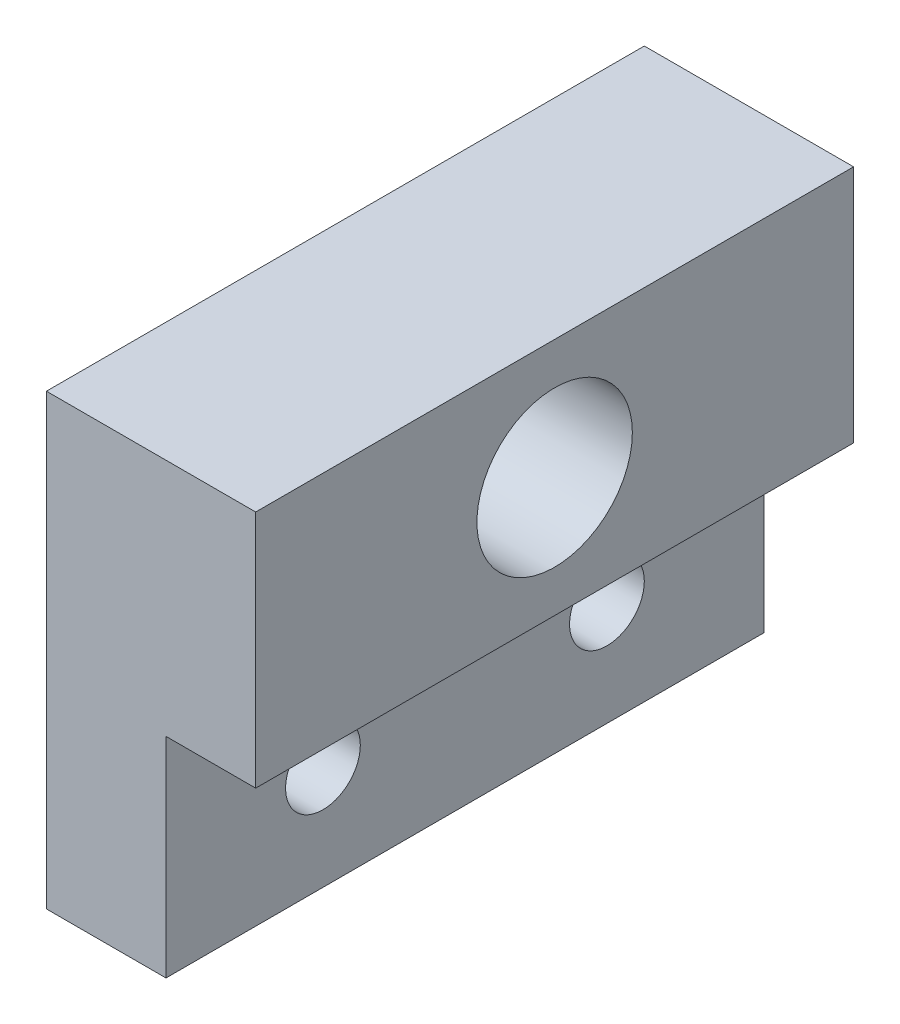
ISO-10303-21;
HEADER;
FILE_DESCRIPTION(('STEP AP214'),'2;1');
FILE_NAME('part.step','',(''),(''),'','','');
FILE_SCHEMA(('AUTOMOTIVE_DESIGN { 1 0 10303 214 1 1 1 1 }'));
ENDSEC;
DATA;
#1=APPLICATION_CONTEXT('core data for automotive mechanical design processes');
#2=APPLICATION_PROTOCOL_DEFINITION('international standard','automotive_design',2000,#1);
#3=PRODUCT_CONTEXT('',#1,'mechanical');
#4=PRODUCT('Part','Part','',(#3));
#5=PRODUCT_RELATED_PRODUCT_CATEGORY('part','',(#4));
#6=PRODUCT_DEFINITION_FORMATION('','',#4);
#7=PRODUCT_DEFINITION_CONTEXT('part definition',#1,'design');
#8=PRODUCT_DEFINITION('design','',#6,#7);
#9=PRODUCT_DEFINITION_SHAPE('','',#8);
#10=(LENGTH_UNIT() NAMED_UNIT(*) SI_UNIT(.MILLI.,.METRE.));
#11=(NAMED_UNIT(*) PLANE_ANGLE_UNIT() SI_UNIT($,.RADIAN.));
#12=(NAMED_UNIT(*) SI_UNIT($,.STERADIAN.) SOLID_ANGLE_UNIT());
#13=UNCERTAINTY_MEASURE_WITH_UNIT(LENGTH_MEASURE(1.E-05),#10,'distance_accuracy_value','');
#14=(GEOMETRIC_REPRESENTATION_CONTEXT(3) GLOBAL_UNCERTAINTY_ASSIGNED_CONTEXT((#13)) GLOBAL_UNIT_ASSIGNED_CONTEXT((#10,
#11,#12)) REPRESENTATION_CONTEXT('',''));
#15=CARTESIAN_POINT('',(0.,0.,0.));
#16=DIRECTION('',(0.,0.,1.));
#17=DIRECTION('',(1.,0.,0.));
#18=AXIS2_PLACEMENT_3D('',#15,#16,#17);
#19=CARTESIAN_POINT('',(7.,7.,20.));
#20=DIRECTION('',(-1.,0.,0.));
#21=DIRECTION('',(0.,0.,1.));
#22=AXIS2_PLACEMENT_3D('',#19,#20,#21);
#23=PLANE('',#22);
#24=CARTESIAN_POINT('',(7.,11.,10.));
#25=DIRECTION('',(1.,0.,0.));
#26=DIRECTION('',(0.,0.,-1.));
#27=AXIS2_PLACEMENT_3D('',#24,#25,#26);
#28=CIRCLE('',#27,2.6);
#29=CARTESIAN_POINT('',(7.,11.,7.4));
#30=VERTEX_POINT('',#29);
#31=EDGE_CURVE('E160',#30,#30,#28,.T.);
#32=ORIENTED_EDGE('',*,*,#31,.F.);
#33=EDGE_LOOP('',(#32));
#34=FACE_BOUND('',#33,.T.);
#35=DIRECTION('',(0.,1.,0.));
#36=VECTOR('',#35,1.);
#37=CARTESIAN_POINT('',(7.,7.,0.));
#38=LINE('',#37,#36);
#39=CARTESIAN_POINT('',(7.,7.,0.));
#40=VERTEX_POINT('',#39);
#41=CARTESIAN_POINT('',(7.,15.,0.));
#42=VERTEX_POINT('',#41);
#43=EDGE_CURVE('E117',#40,#42,#38,.T.);
#44=ORIENTED_EDGE('',*,*,#43,.T.);
#45=DIRECTION('',(0.,0.,-1.));
#46=VECTOR('',#45,1.);
#47=CARTESIAN_POINT('',(7.,15.,20.));
#48=LINE('',#47,#46);
#49=CARTESIAN_POINT('',(7.,15.,20.));
#50=VERTEX_POINT('',#49);
#51=EDGE_CURVE('E11',#50,#42,#48,.T.);
#52=ORIENTED_EDGE('',*,*,#51,.F.);
#53=DIRECTION('',(0.,1.,0.));
#54=VECTOR('',#53,1.);
#55=CARTESIAN_POINT('',(7.,7.,20.));
#56=LINE('',#55,#54);
#57=CARTESIAN_POINT('',(7.,7.,20.));
#58=VERTEX_POINT('',#57);
#59=EDGE_CURVE('E128',#58,#50,#56,.T.);
#60=ORIENTED_EDGE('',*,*,#59,.F.);
#61=DIRECTION('',(0.,0.,-1.));
#62=VECTOR('',#61,1.);
#63=CARTESIAN_POINT('',(7.,7.,20.));
#64=LINE('',#63,#62);
#65=EDGE_CURVE('E113',#58,#40,#64,.T.);
#66=ORIENTED_EDGE('',*,*,#65,.T.);
#67=EDGE_LOOP('',(#44,#52,#60,#66));
#68=FACE_BOUND('',#67,.T.);
#69=ADVANCED_FACE('F33',(#34,#68),#23,.F.);
#70=CARTESIAN_POINT('',(7.,15.,20.));
#71=DIRECTION('',(0.,-1.,0.));
#72=DIRECTION('',(0.,0.,-1.));
#73=AXIS2_PLACEMENT_3D('',#70,#71,#72);
#74=PLANE('',#73);
#75=DIRECTION('',(-1.,0.,0.));
#76=VECTOR('',#75,1.);
#77=CARTESIAN_POINT('',(7.,15.,0.));
#78=LINE('',#77,#76);
#79=CARTESIAN_POINT('',(0.,15.,0.));
#80=VERTEX_POINT('',#79);
#81=EDGE_CURVE('E120',#42,#80,#78,.T.);
#82=ORIENTED_EDGE('',*,*,#81,.T.);
#83=DIRECTION('',(0.,0.,-1.));
#84=VECTOR('',#83,1.);
#85=CARTESIAN_POINT('',(0.,15.,20.));
#86=LINE('',#85,#84);
#87=CARTESIAN_POINT('',(0.,15.,20.));
#88=VERTEX_POINT('',#87);
#89=EDGE_CURVE('E41',#88,#80,#86,.T.);
#90=ORIENTED_EDGE('',*,*,#89,.F.);
#91=DIRECTION('',(-1.,0.,0.));
#92=VECTOR('',#91,1.);
#93=CARTESIAN_POINT('',(7.,15.,20.));
#94=LINE('',#93,#92);
#95=EDGE_CURVE('E86',#50,#88,#94,.T.);
#96=ORIENTED_EDGE('',*,*,#95,.F.);
#97=ORIENTED_EDGE('',*,*,#51,.T.);
#98=EDGE_LOOP('',(#82,#90,#96,#97));
#99=FACE_BOUND('',#98,.T.);
#100=ADVANCED_FACE('F153',(#99),#74,.F.);
#101=CARTESIAN_POINT('',(0.,15.,20.));
#102=DIRECTION('',(1.,0.,0.));
#103=DIRECTION('',(0.,1.,0.));
#104=AXIS2_PLACEMENT_3D('',#101,#102,#103);
#105=PLANE('',#104);
#106=CARTESIAN_POINT('',(0.,3.49787588451187,5.25));
#107=DIRECTION('',(1.,0.,0.));
#108=DIRECTION('',(0.,1.,0.));
#109=AXIS2_PLACEMENT_3D('',#106,#107,#108);
#110=CIRCLE('',#109,1.25);
#111=CARTESIAN_POINT('',(0.,4.74787588451187,5.25));
#112=VERTEX_POINT('',#111);
#113=EDGE_CURVE('E174',#112,#112,#110,.F.);
#114=ORIENTED_EDGE('',*,*,#113,.F.);
#115=EDGE_LOOP('',(#114));
#116=FACE_BOUND('',#115,.T.);
#117=CARTESIAN_POINT('',(0.,3.49787588451187,14.75));
#118=DIRECTION('',(1.,0.,0.));
#119=DIRECTION('',(0.,1.,0.));
#120=AXIS2_PLACEMENT_3D('',#117,#118,#119);
#121=CIRCLE('',#120,1.25);
#122=CARTESIAN_POINT('',(0.,4.74787588451187,14.75));
#123=VERTEX_POINT('',#122);
#124=EDGE_CURVE('E162',#123,#123,#121,.F.);
#125=ORIENTED_EDGE('',*,*,#124,.F.);
#126=EDGE_LOOP('',(#125));
#127=FACE_BOUND('',#126,.T.);
#128=CARTESIAN_POINT('',(0.,11.,10.));
#129=DIRECTION('',(1.,0.,0.));
#130=DIRECTION('',(0.,1.,0.));
#131=AXIS2_PLACEMENT_3D('',#128,#129,#130);
#132=CIRCLE('',#131,2.6);
#133=CARTESIAN_POINT('',(0.,13.6,10.));
#134=VERTEX_POINT('',#133);
#135=EDGE_CURVE('E121',#134,#134,#132,.F.);
#136=ORIENTED_EDGE('',*,*,#135,.F.);
#137=EDGE_LOOP('',(#136));
#138=FACE_BOUND('',#137,.T.);
#139=DIRECTION('',(0.,-1.,0.));
#140=VECTOR('',#139,1.);
#141=CARTESIAN_POINT('',(0.,15.,0.));
#142=LINE('',#141,#140);
#143=CARTESIAN_POINT('',(0.,0.,0.));
#144=VERTEX_POINT('',#143);
#145=EDGE_CURVE('E123',#80,#144,#142,.T.);
#146=ORIENTED_EDGE('',*,*,#145,.T.);
#147=DIRECTION('',(0.,0.,-1.));
#148=VECTOR('',#147,1.);
#149=CARTESIAN_POINT('',(0.,0.,20.));
#150=LINE('',#149,#148);
#151=CARTESIAN_POINT('',(0.,0.,20.));
#152=VERTEX_POINT('',#151);
#153=EDGE_CURVE('E108',#152,#144,#150,.T.);
#154=ORIENTED_EDGE('',*,*,#153,.F.);
#155=DIRECTION('',(0.,-1.,0.));
#156=VECTOR('',#155,1.);
#157=CARTESIAN_POINT('',(0.,15.,20.));
#158=LINE('',#157,#156);
#159=EDGE_CURVE('E99',#88,#152,#158,.T.);
#160=ORIENTED_EDGE('',*,*,#159,.F.);
#161=ORIENTED_EDGE('',*,*,#89,.T.);
#162=EDGE_LOOP('',(#146,#154,#160,#161));
#163=FACE_BOUND('',#162,.T.);
#164=ADVANCED_FACE('F134',(#116,#127,#138,#163),#105,.F.);
#165=CARTESIAN_POINT('',(0.,0.,20.));
#166=DIRECTION('',(0.,1.,0.));
#167=DIRECTION('',(0.,0.,1.));
#168=AXIS2_PLACEMENT_3D('',#165,#166,#167);
#169=PLANE('',#168);
#170=DIRECTION('',(1.,0.,0.));
#171=VECTOR('',#170,1.);
#172=CARTESIAN_POINT('',(0.,0.,0.));
#173=LINE('',#172,#171);
#174=CARTESIAN_POINT('',(4.,0.,0.));
#175=VERTEX_POINT('',#174);
#176=EDGE_CURVE('E107',#144,#175,#173,.T.);
#177=ORIENTED_EDGE('',*,*,#176,.T.);
#178=DIRECTION('',(0.,0.,-1.));
#179=VECTOR('',#178,1.);
#180=CARTESIAN_POINT('',(4.,0.,20.));
#181=LINE('',#180,#179);
#182=CARTESIAN_POINT('',(4.,0.,20.));
#183=VERTEX_POINT('',#182);
#184=EDGE_CURVE('E104',#183,#175,#181,.T.);
#185=ORIENTED_EDGE('',*,*,#184,.F.);
#186=DIRECTION('',(1.,0.,0.));
#187=VECTOR('',#186,1.);
#188=CARTESIAN_POINT('',(0.,0.,20.));
#189=LINE('',#188,#187);
#190=EDGE_CURVE('E93',#152,#183,#189,.T.);
#191=ORIENTED_EDGE('',*,*,#190,.F.);
#192=ORIENTED_EDGE('',*,*,#153,.T.);
#193=EDGE_LOOP('',(#177,#185,#191,#192));
#194=FACE_BOUND('',#193,.T.);
#195=ADVANCED_FACE('F105',(#194),#169,.F.);
#196=CARTESIAN_POINT('',(4.,0.,20.));
#197=DIRECTION('',(-1.,0.,0.));
#198=DIRECTION('',(0.,0.,1.));
#199=AXIS2_PLACEMENT_3D('',#196,#197,#198);
#200=PLANE('',#199);
#201=CARTESIAN_POINT('',(4.,3.49787588451187,5.25));
#202=DIRECTION('',(1.,0.,0.));
#203=DIRECTION('',(0.,0.,-1.));
#204=AXIS2_PLACEMENT_3D('',#201,#202,#203);
#205=CIRCLE('',#204,1.25);
#206=CARTESIAN_POINT('',(4.,3.49787588451187,4.));
#207=VERTEX_POINT('',#206);
#208=EDGE_CURVE('E177',#207,#207,#205,.T.);
#209=ORIENTED_EDGE('',*,*,#208,.F.);
#210=EDGE_LOOP('',(#209));
#211=FACE_BOUND('',#210,.T.);
#212=CARTESIAN_POINT('',(4.,3.49787588451187,14.75));
#213=DIRECTION('',(1.,0.,0.));
#214=DIRECTION('',(0.,0.,-1.));
#215=AXIS2_PLACEMENT_3D('',#212,#213,#214);
#216=CIRCLE('',#215,1.25);
#217=CARTESIAN_POINT('',(4.,3.49787588451187,13.5));
#218=VERTEX_POINT('',#217);
#219=EDGE_CURVE('E167',#218,#218,#216,.T.);
#220=ORIENTED_EDGE('',*,*,#219,.F.);
#221=EDGE_LOOP('',(#220));
#222=FACE_BOUND('',#221,.T.);
#223=DIRECTION('',(0.,1.,0.));
#224=VECTOR('',#223,1.);
#225=CARTESIAN_POINT('',(4.,0.,0.));
#226=LINE('',#225,#224);
#227=CARTESIAN_POINT('',(4.,7.,0.));
#228=VERTEX_POINT('',#227);
#229=EDGE_CURVE('E72',#175,#228,#226,.T.);
#230=ORIENTED_EDGE('',*,*,#229,.T.);
#231=DIRECTION('',(0.,0.,-1.));
#232=VECTOR('',#231,1.);
#233=CARTESIAN_POINT('',(4.,7.,20.));
#234=LINE('',#233,#232);
#235=CARTESIAN_POINT('',(4.,7.,20.));
#236=VERTEX_POINT('',#235);
#237=EDGE_CURVE('E109',#236,#228,#234,.T.);
#238=ORIENTED_EDGE('',*,*,#237,.F.);
#239=DIRECTION('',(0.,1.,0.));
#240=VECTOR('',#239,1.);
#241=CARTESIAN_POINT('',(4.,0.,20.));
#242=LINE('',#241,#240);
#243=EDGE_CURVE('E97',#183,#236,#242,.T.);
#244=ORIENTED_EDGE('',*,*,#243,.F.);
#245=ORIENTED_EDGE('',*,*,#184,.T.);
#246=EDGE_LOOP('',(#230,#238,#244,#245));
#247=FACE_BOUND('',#246,.T.);
#248=ADVANCED_FACE('F111',(#211,#222,#247),#200,.F.);
#249=CARTESIAN_POINT('',(4.,7.,20.));
#250=DIRECTION('',(0.,1.,0.));
#251=DIRECTION('',(0.,0.,1.));
#252=AXIS2_PLACEMENT_3D('',#249,#250,#251);
#253=PLANE('',#252);
#254=DIRECTION('',(1.,0.,0.));
#255=VECTOR('',#254,1.);
#256=CARTESIAN_POINT('',(4.,7.,0.));
#257=LINE('',#256,#255);
#258=EDGE_CURVE('E78',#228,#40,#257,.T.);
#259=ORIENTED_EDGE('',*,*,#258,.T.);
#260=ORIENTED_EDGE('',*,*,#65,.F.);
#261=DIRECTION('',(1.,0.,0.));
#262=VECTOR('',#261,1.);
#263=CARTESIAN_POINT('',(4.,7.,20.));
#264=LINE('',#263,#262);
#265=EDGE_CURVE('E49',#236,#58,#264,.T.);
#266=ORIENTED_EDGE('',*,*,#265,.F.);
#267=ORIENTED_EDGE('',*,*,#237,.T.);
#268=EDGE_LOOP('',(#259,#260,#266,#267));
#269=FACE_BOUND('',#268,.T.);
#270=ADVANCED_FACE('F141',(#269),#253,.F.);
#271=CARTESIAN_POINT('',(0.,0.,20.));
#272=DIRECTION('',(0.,0.,1.));
#273=DIRECTION('',(1.,0.,0.));
#274=AXIS2_PLACEMENT_3D('',#271,#272,#273);
#275=PLANE('',#274);
#276=ORIENTED_EDGE('',*,*,#59,.T.);
#277=ORIENTED_EDGE('',*,*,#95,.T.);
#278=ORIENTED_EDGE('',*,*,#159,.T.);
#279=ORIENTED_EDGE('',*,*,#190,.T.);
#280=ORIENTED_EDGE('',*,*,#243,.T.);
#281=ORIENTED_EDGE('',*,*,#265,.T.);
#282=EDGE_LOOP('',(#276,#277,#278,#279,#280,#281));
#283=FACE_BOUND('',#282,.T.);
#284=ADVANCED_FACE('F95',(#283),#275,.T.);
#285=CARTESIAN_POINT('',(0.,0.,0.));
#286=DIRECTION('',(0.,0.,1.));
#287=DIRECTION('',(1.,0.,0.));
#288=AXIS2_PLACEMENT_3D('',#285,#286,#287);
#289=PLANE('',#288);
#290=ORIENTED_EDGE('',*,*,#43,.F.);
#291=ORIENTED_EDGE('',*,*,#258,.F.);
#292=ORIENTED_EDGE('',*,*,#229,.F.);
#293=ORIENTED_EDGE('',*,*,#176,.F.);
#294=ORIENTED_EDGE('',*,*,#145,.F.);
#295=ORIENTED_EDGE('',*,*,#81,.F.);
#296=EDGE_LOOP('',(#290,#291,#292,#293,#294,#295));
#297=FACE_BOUND('',#296,.T.);
#298=ADVANCED_FACE('F137',(#297),#289,.F.);
#299=CARTESIAN_POINT('',(-0.00100000000000013,11.,10.));
#300=DIRECTION('',(1.,0.,0.));
#301=DIRECTION('',(0.,0.,-1.));
#302=AXIS2_PLACEMENT_3D('',#299,#300,#301);
#303=CYLINDRICAL_SURFACE('',#302,2.6);
#304=ORIENTED_EDGE('',*,*,#31,.T.);
#305=EDGE_LOOP('',(#304));
#306=FACE_BOUND('',#305,.T.);
#307=ORIENTED_EDGE('',*,*,#135,.T.);
#308=EDGE_LOOP('',(#307));
#309=FACE_BOUND('',#308,.T.);
#310=ADVANCED_FACE('F189',(#306,#309),#303,.F.);
#311=CARTESIAN_POINT('',(-0.00100000000000013,3.49787588451187,14.75));
#312=DIRECTION('',(1.,0.,0.));
#313=DIRECTION('',(0.,0.,-1.));
#314=AXIS2_PLACEMENT_3D('',#311,#312,#313);
#315=CYLINDRICAL_SURFACE('',#314,1.25);
#316=ORIENTED_EDGE('',*,*,#219,.T.);
#317=EDGE_LOOP('',(#316));
#318=FACE_BOUND('',#317,.T.);
#319=ORIENTED_EDGE('',*,*,#124,.T.);
#320=EDGE_LOOP('',(#319));
#321=FACE_BOUND('',#320,.T.);
#322=ADVANCED_FACE('F186',(#318,#321),#315,.F.);
#323=CARTESIAN_POINT('',(-0.00100000000000013,3.49787588451187,5.25));
#324=DIRECTION('',(1.,0.,0.));
#325=DIRECTION('',(0.,0.,-1.));
#326=AXIS2_PLACEMENT_3D('',#323,#324,#325);
#327=CYLINDRICAL_SURFACE('',#326,1.25);
#328=ORIENTED_EDGE('',*,*,#208,.T.);
#329=EDGE_LOOP('',(#328));
#330=FACE_BOUND('',#329,.T.);
#331=ORIENTED_EDGE('',*,*,#113,.T.);
#332=EDGE_LOOP('',(#331));
#333=FACE_BOUND('',#332,.T.);
#334=ADVANCED_FACE('F181',(#330,#333),#327,.F.);
#335=CLOSED_SHELL('',(#69,#100,#164,#195,#248,#270,#284,#298,#310,#322,#334));
#336=MANIFOLD_SOLID_BREP('B2',#335);
#337=ADVANCED_BREP_SHAPE_REPRESENTATION('',(#18,#336),#14);
#338=SHAPE_DEFINITION_REPRESENTATION(#9,#337);
ENDSEC;
END-ISO-10303-21;
